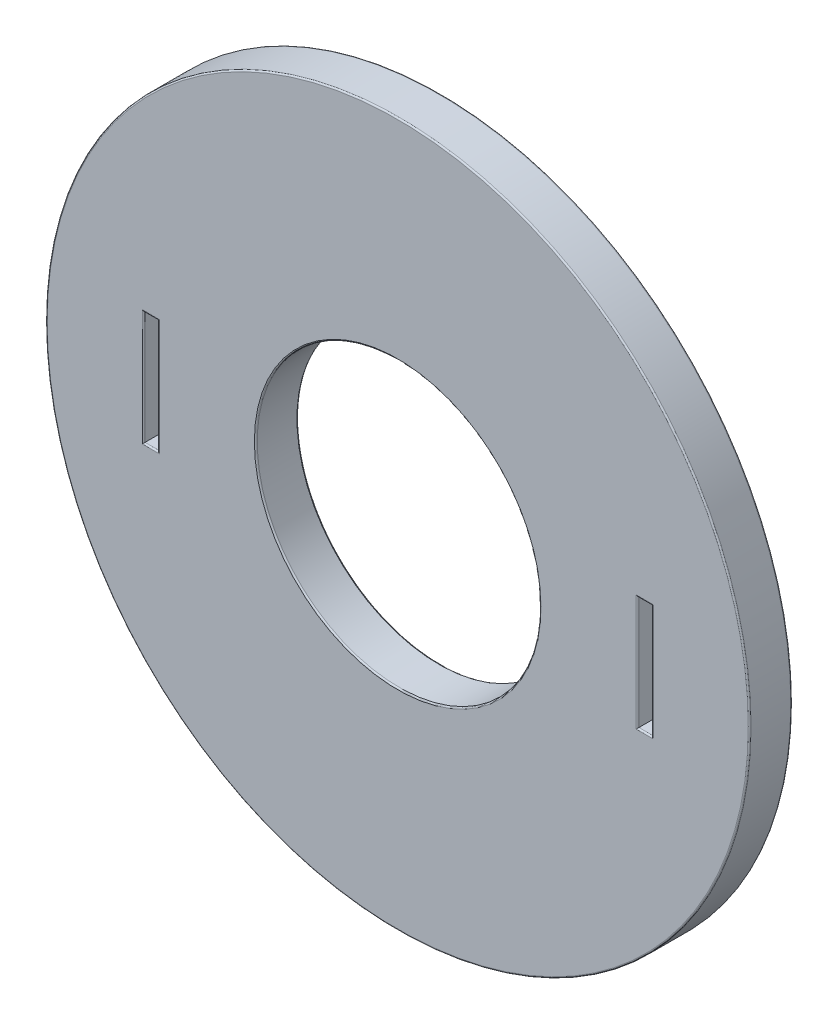
ISO-10303-21;
HEADER;
FILE_DESCRIPTION(('STEP AP214'),'2;1');
FILE_NAME('part.step','',(''),(''),'','','');
FILE_SCHEMA(('AUTOMOTIVE_DESIGN { 1 0 10303 214 1 1 1 1 }'));
ENDSEC;
DATA;
#1=APPLICATION_CONTEXT('core data for automotive mechanical design processes');
#2=APPLICATION_PROTOCOL_DEFINITION('international standard','automotive_design',2000,#1);
#3=PRODUCT_CONTEXT('',#1,'mechanical');
#4=PRODUCT('Part','Part','',(#3));
#5=PRODUCT_RELATED_PRODUCT_CATEGORY('part','',(#4));
#6=PRODUCT_DEFINITION_FORMATION('','',#4);
#7=PRODUCT_DEFINITION_CONTEXT('part definition',#1,'design');
#8=PRODUCT_DEFINITION('design','',#6,#7);
#9=PRODUCT_DEFINITION_SHAPE('','',#8);
#10=(LENGTH_UNIT() NAMED_UNIT(*) SI_UNIT(.MILLI.,.METRE.));
#11=(NAMED_UNIT(*) PLANE_ANGLE_UNIT() SI_UNIT($,.RADIAN.));
#12=(NAMED_UNIT(*) SI_UNIT($,.STERADIAN.) SOLID_ANGLE_UNIT());
#13=UNCERTAINTY_MEASURE_WITH_UNIT(LENGTH_MEASURE(1.E-05),#10,'distance_accuracy_value','');
#14=(GEOMETRIC_REPRESENTATION_CONTEXT(3) GLOBAL_UNCERTAINTY_ASSIGNED_CONTEXT((#13)) GLOBAL_UNIT_ASSIGNED_CONTEXT((#10,
#11,#12)) REPRESENTATION_CONTEXT('',''));
#15=CARTESIAN_POINT('',(0.,0.,0.));
#16=DIRECTION('',(0.,0.,1.));
#17=DIRECTION('',(1.,0.,0.));
#18=AXIS2_PLACEMENT_3D('',#15,#16,#17);
#19=CARTESIAN_POINT('',(0.,0.,1.5));
#20=DIRECTION('',(0.,0.,-1.));
#21=DIRECTION('',(-1.,0.,0.));
#22=AXIS2_PLACEMENT_3D('',#19,#20,#21);
#23=CYLINDRICAL_SURFACE('',#22,12.4);
#24=CARTESIAN_POINT('',(0.,0.,0.0499999999999999));
#25=DIRECTION('',(0.,0.,1.));
#26=DIRECTION('',(1.,0.,0.));
#27=AXIS2_PLACEMENT_3D('',#24,#25,#26);
#28=CIRCLE('',#27,12.4);
#29=CARTESIAN_POINT('',(12.4,0.,0.0499999999999999));
#30=VERTEX_POINT('',#29);
#31=EDGE_CURVE('E175',#30,#30,#28,.T.);
#32=ORIENTED_EDGE('',*,*,#31,.T.);
#33=EDGE_LOOP('',(#32));
#34=FACE_BOUND('',#33,.T.);
#35=CARTESIAN_POINT('',(0.,0.,1.45));
#36=DIRECTION('',(0.,0.,1.));
#37=DIRECTION('',(1.,0.,0.));
#38=AXIS2_PLACEMENT_3D('',#35,#36,#37);
#39=CIRCLE('',#38,12.4);
#40=CARTESIAN_POINT('',(12.4,0.,1.45));
#41=VERTEX_POINT('',#40);
#42=EDGE_CURVE('E424',#41,#41,#39,.F.);
#43=ORIENTED_EDGE('',*,*,#42,.T.);
#44=EDGE_LOOP('',(#43));
#45=FACE_BOUND('',#44,.T.);
#46=ADVANCED_FACE('F34',(#34,#45),#23,.T.);
#47=CARTESIAN_POINT('',(0.,0.,1.5));
#48=DIRECTION('',(0.,0.,1.));
#49=DIRECTION('',(1.,0.,0.));
#50=AXIS2_PLACEMENT_3D('',#47,#48,#49);
#51=PLANE('',#50);
#52=CARTESIAN_POINT('',(0.,0.,1.5));
#53=DIRECTION('',(0.,0.,1.));
#54=DIRECTION('',(1.,0.,0.));
#55=AXIS2_PLACEMENT_3D('',#52,#53,#54);
#56=CIRCLE('',#55,12.35);
#57=CARTESIAN_POINT('',(12.35,0.,1.5));
#58=VERTEX_POINT('',#57);
#59=EDGE_CURVE('E215',#58,#58,#56,.T.);
#60=ORIENTED_EDGE('',*,*,#59,.T.);
#61=EDGE_LOOP('',(#60));
#62=FACE_BOUND('',#61,.T.);
#63=CARTESIAN_POINT('',(0.,0.,1.5));
#64=DIRECTION('',(0.,0.,1.));
#65=DIRECTION('',(1.,0.,0.));
#66=AXIS2_PLACEMENT_3D('',#63,#64,#65);
#67=CIRCLE('',#66,5.05);
#68=CARTESIAN_POINT('',(5.05,0.,1.5));
#69=VERTEX_POINT('',#68);
#70=EDGE_CURVE('E212',#69,#69,#67,.F.);
#71=ORIENTED_EDGE('',*,*,#70,.T.);
#72=EDGE_LOOP('',(#71));
#73=FACE_BOUND('',#72,.T.);
#74=DIRECTION('',(0.,1.,0.));
#75=VECTOR('',#74,1.);
#76=CARTESIAN_POINT('',(-8.4,-2.,1.5));
#77=LINE('',#76,#75);
#78=CARTESIAN_POINT('',(-8.4,2.05,1.5));
#79=VERTEX_POINT('',#78);
#80=CARTESIAN_POINT('',(-8.4,-2.05,1.5));
#81=VERTEX_POINT('',#80);
#82=EDGE_CURVE('E207',#79,#81,#77,.F.);
#83=ORIENTED_EDGE('',*,*,#82,.T.);
#84=DIRECTION('',(1.,0.,0.));
#85=VECTOR('',#84,1.);
#86=CARTESIAN_POINT('',(-8.95,-2.05,1.5));
#87=LINE('',#86,#85);
#88=CARTESIAN_POINT('',(-9.,-2.05,1.5));
#89=VERTEX_POINT('',#88);
#90=EDGE_CURVE('E209',#81,#89,#87,.F.);
#91=ORIENTED_EDGE('',*,*,#90,.T.);
#92=DIRECTION('',(0.,-1.,0.));
#93=VECTOR('',#92,1.);
#94=CARTESIAN_POINT('',(-9.,2.,1.5));
#95=LINE('',#94,#93);
#96=CARTESIAN_POINT('',(-9.,2.05,1.5));
#97=VERTEX_POINT('',#96);
#98=EDGE_CURVE('E203',#89,#97,#95,.F.);
#99=ORIENTED_EDGE('',*,*,#98,.T.);
#100=DIRECTION('',(-1.,0.,0.));
#101=VECTOR('',#100,1.);
#102=CARTESIAN_POINT('',(-8.45,2.05,1.5));
#103=LINE('',#102,#101);
#104=EDGE_CURVE('E205',#97,#79,#103,.F.);
#105=ORIENTED_EDGE('',*,*,#104,.T.);
#106=EDGE_LOOP('',(#83,#91,#99,#105));
#107=FACE_BOUND('',#106,.T.);
#108=DIRECTION('',(0.,1.,0.));
#109=VECTOR('',#108,1.);
#110=CARTESIAN_POINT('',(9.,-2.,1.5));
#111=LINE('',#110,#109);
#112=CARTESIAN_POINT('',(9.,2.05,1.5));
#113=VERTEX_POINT('',#112);
#114=CARTESIAN_POINT('',(9.,-2.05,1.5));
#115=VERTEX_POINT('',#114);
#116=EDGE_CURVE('E198',#113,#115,#111,.F.);
#117=ORIENTED_EDGE('',*,*,#116,.T.);
#118=DIRECTION('',(1.,0.,0.));
#119=VECTOR('',#118,1.);
#120=CARTESIAN_POINT('',(8.45,-2.05,1.5));
#121=LINE('',#120,#119);
#122=CARTESIAN_POINT('',(8.4,-2.05,1.5));
#123=VERTEX_POINT('',#122);
#124=EDGE_CURVE('E200',#115,#123,#121,.F.);
#125=ORIENTED_EDGE('',*,*,#124,.T.);
#126=DIRECTION('',(0.,-1.,0.));
#127=VECTOR('',#126,1.);
#128=CARTESIAN_POINT('',(8.4,2.,1.5));
#129=LINE('',#128,#127);
#130=CARTESIAN_POINT('',(8.4,2.05,1.5));
#131=VERTEX_POINT('',#130);
#132=EDGE_CURVE('E194',#123,#131,#129,.F.);
#133=ORIENTED_EDGE('',*,*,#132,.T.);
#134=DIRECTION('',(-1.,0.,0.));
#135=VECTOR('',#134,1.);
#136=CARTESIAN_POINT('',(8.95,2.05,1.5));
#137=LINE('',#136,#135);
#138=EDGE_CURVE('E196',#131,#113,#137,.F.);
#139=ORIENTED_EDGE('',*,*,#138,.T.);
#140=EDGE_LOOP('',(#117,#125,#133,#139));
#141=FACE_BOUND('',#140,.T.);
#142=ADVANCED_FACE('F316',(#62,#73,#107,#141),#51,.T.);
#143=CARTESIAN_POINT('',(0.,0.,0.));
#144=DIRECTION('',(0.,0.,1.));
#145=DIRECTION('',(1.,0.,0.));
#146=AXIS2_PLACEMENT_3D('',#143,#144,#145);
#147=PLANE('',#146);
#148=CARTESIAN_POINT('',(0.,0.,0.));
#149=DIRECTION('',(0.,0.,1.));
#150=DIRECTION('',(1.,0.,0.));
#151=AXIS2_PLACEMENT_3D('',#148,#149,#150);
#152=CIRCLE('',#151,12.35);
#153=CARTESIAN_POINT('',(12.35,0.,0.));
#154=VERTEX_POINT('',#153);
#155=EDGE_CURVE('E191',#154,#154,#152,.F.);
#156=ORIENTED_EDGE('',*,*,#155,.T.);
#157=EDGE_LOOP('',(#156));
#158=FACE_BOUND('',#157,.T.);
#159=DIRECTION('',(0.,-1.,0.));
#160=VECTOR('',#159,1.);
#161=CARTESIAN_POINT('',(-9.,0.,0.));
#162=LINE('',#161,#160);
#163=CARTESIAN_POINT('',(-9.,2.05,0.));
#164=VERTEX_POINT('',#163);
#165=CARTESIAN_POINT('',(-9.,-2.05,0.));
#166=VERTEX_POINT('',#165);
#167=EDGE_CURVE('E186',#164,#166,#162,.T.);
#168=ORIENTED_EDGE('',*,*,#167,.T.);
#169=DIRECTION('',(1.,0.,0.));
#170=VECTOR('',#169,1.);
#171=CARTESIAN_POINT('',(0.,-2.05,0.));
#172=LINE('',#171,#170);
#173=CARTESIAN_POINT('',(-8.4,-2.05,0.));
#174=VERTEX_POINT('',#173);
#175=EDGE_CURVE('E188',#166,#174,#172,.T.);
#176=ORIENTED_EDGE('',*,*,#175,.T.);
#177=DIRECTION('',(0.,1.,0.));
#178=VECTOR('',#177,1.);
#179=CARTESIAN_POINT('',(-8.4,0.,0.));
#180=LINE('',#179,#178);
#181=CARTESIAN_POINT('',(-8.4,2.05,0.));
#182=VERTEX_POINT('',#181);
#183=EDGE_CURVE('E184',#174,#182,#180,.T.);
#184=ORIENTED_EDGE('',*,*,#183,.T.);
#185=DIRECTION('',(-1.,0.,0.));
#186=VECTOR('',#185,1.);
#187=CARTESIAN_POINT('',(0.,2.04999999999999,0.));
#188=LINE('',#187,#186);
#189=EDGE_CURVE('E182',#182,#164,#188,.T.);
#190=ORIENTED_EDGE('',*,*,#189,.T.);
#191=EDGE_LOOP('',(#168,#176,#184,#190));
#192=FACE_BOUND('',#191,.T.);
#193=DIRECTION('',(0.,-1.,0.));
#194=VECTOR('',#193,1.);
#195=CARTESIAN_POINT('',(8.4,0.,0.));
#196=LINE('',#195,#194);
#197=CARTESIAN_POINT('',(8.4,2.05,0.));
#198=VERTEX_POINT('',#197);
#199=CARTESIAN_POINT('',(8.4,-2.05,0.));
#200=VERTEX_POINT('',#199);
#201=EDGE_CURVE('E154',#198,#200,#196,.T.);
#202=ORIENTED_EDGE('',*,*,#201,.T.);
#203=DIRECTION('',(1.,0.,0.));
#204=VECTOR('',#203,1.);
#205=CARTESIAN_POINT('',(0.,-2.05,0.));
#206=LINE('',#205,#204);
#207=CARTESIAN_POINT('',(9.,-2.05,0.));
#208=VERTEX_POINT('',#207);
#209=EDGE_CURVE('E180',#200,#208,#206,.T.);
#210=ORIENTED_EDGE('',*,*,#209,.T.);
#211=DIRECTION('',(0.,1.,0.));
#212=VECTOR('',#211,1.);
#213=CARTESIAN_POINT('',(9.,0.,0.));
#214=LINE('',#213,#212);
#215=CARTESIAN_POINT('',(9.,2.05,0.));
#216=VERTEX_POINT('',#215);
#217=EDGE_CURVE('E157',#208,#216,#214,.T.);
#218=ORIENTED_EDGE('',*,*,#217,.T.);
#219=DIRECTION('',(-1.,0.,0.));
#220=VECTOR('',#219,1.);
#221=CARTESIAN_POINT('',(0.,2.05000000000001,0.));
#222=LINE('',#221,#220);
#223=EDGE_CURVE('E148',#216,#198,#222,.T.);
#224=ORIENTED_EDGE('',*,*,#223,.T.);
#225=EDGE_LOOP('',(#202,#210,#218,#224));
#226=FACE_BOUND('',#225,.T.);
#227=CARTESIAN_POINT('',(0.,0.,0.));
#228=DIRECTION('',(0.,0.,1.));
#229=DIRECTION('',(1.,0.,0.));
#230=AXIS2_PLACEMENT_3D('',#227,#228,#229);
#231=CIRCLE('',#230,5.05);
#232=CARTESIAN_POINT('',(5.05,0.,0.));
#233=VERTEX_POINT('',#232);
#234=EDGE_CURVE('E172',#233,#233,#231,.T.);
#235=ORIENTED_EDGE('',*,*,#234,.T.);
#236=EDGE_LOOP('',(#235));
#237=FACE_BOUND('',#236,.T.);
#238=ADVANCED_FACE('F150',(#158,#192,#226,#237),#147,.F.);
#239=CARTESIAN_POINT('',(0.,0.,0.));
#240=DIRECTION('',(0.,0.,1.));
#241=DIRECTION('',(1.,0.,0.));
#242=AXIS2_PLACEMENT_3D('',#239,#240,#241);
#243=CYLINDRICAL_SURFACE('',#242,5.);
#244=CARTESIAN_POINT('',(0.,0.,1.45));
#245=DIRECTION('',(0.,0.,1.));
#246=DIRECTION('',(1.,0.,0.));
#247=AXIS2_PLACEMENT_3D('',#244,#245,#246);
#248=CIRCLE('',#247,5.);
#249=CARTESIAN_POINT('',(5.,0.,1.45));
#250=VERTEX_POINT('',#249);
#251=EDGE_CURVE('E221',#250,#250,#248,.T.);
#252=ORIENTED_EDGE('',*,*,#251,.T.);
#253=EDGE_LOOP('',(#252));
#254=FACE_BOUND('',#253,.T.);
#255=CARTESIAN_POINT('',(0.,0.,0.05));
#256=DIRECTION('',(0.,0.,1.));
#257=DIRECTION('',(1.,0.,0.));
#258=AXIS2_PLACEMENT_3D('',#255,#256,#257);
#259=CIRCLE('',#258,5.);
#260=CARTESIAN_POINT('',(5.,0.,0.05));
#261=VERTEX_POINT('',#260);
#262=EDGE_CURVE('E218',#261,#261,#259,.F.);
#263=ORIENTED_EDGE('',*,*,#262,.T.);
#264=EDGE_LOOP('',(#263));
#265=FACE_BOUND('',#264,.T.);
#266=ADVANCED_FACE('F467',(#254,#265),#243,.F.);
#267=CARTESIAN_POINT('',(-8.95,2.,0.));
#268=DIRECTION('',(-1.,0.,0.));
#269=DIRECTION('',(0.,0.,1.));
#270=AXIS2_PLACEMENT_3D('',#267,#268,#269);
#271=PLANE('',#270);
#272=DIRECTION('',(0.,0.,1.));
#273=VECTOR('',#272,1.);
#274=CARTESIAN_POINT('',(-8.95,2.,0.));
#275=LINE('',#274,#273);
#276=CARTESIAN_POINT('',(-8.95,2.,0.05));
#277=VERTEX_POINT('',#276);
#278=CARTESIAN_POINT('',(-8.95,2.,1.45));
#279=VERTEX_POINT('',#278);
#280=EDGE_CURVE('E419',#277,#279,#275,.T.);
#281=ORIENTED_EDGE('',*,*,#280,.T.);
#282=DIRECTION('',(0.,-1.,0.));
#283=VECTOR('',#282,1.);
#284=CARTESIAN_POINT('',(-8.95,-2.,1.45));
#285=LINE('',#284,#283);
#286=CARTESIAN_POINT('',(-8.95,-2.,1.45));
#287=VERTEX_POINT('',#286);
#288=EDGE_CURVE('E240',#279,#287,#285,.T.);
#289=ORIENTED_EDGE('',*,*,#288,.T.);
#290=DIRECTION('',(0.,0.,1.));
#291=VECTOR('',#290,1.);
#292=CARTESIAN_POINT('',(-8.95,-2.,0.));
#293=LINE('',#292,#291);
#294=CARTESIAN_POINT('',(-8.95,-2.,0.05));
#295=VERTEX_POINT('',#294);
#296=EDGE_CURVE('E409',#295,#287,#293,.T.);
#297=ORIENTED_EDGE('',*,*,#296,.F.);
#298=DIRECTION('',(0.,-1.,0.));
#299=VECTOR('',#298,1.);
#300=CARTESIAN_POINT('',(-8.95,2.,0.05));
#301=LINE('',#300,#299);
#302=EDGE_CURVE('E238',#295,#277,#301,.F.);
#303=ORIENTED_EDGE('',*,*,#302,.T.);
#304=EDGE_LOOP('',(#281,#289,#297,#303));
#305=FACE_BOUND('',#304,.T.);
#306=ADVANCED_FACE('F418',(#305),#271,.F.);
#307=CARTESIAN_POINT('',(-8.95,2.,0.));
#308=DIRECTION('',(0.,1.,0.));
#309=DIRECTION('',(-1.,0.,0.));
#310=AXIS2_PLACEMENT_3D('',#307,#308,#309);
#311=PLANE('',#310);
#312=DIRECTION('',(0.,0.,1.));
#313=VECTOR('',#312,1.);
#314=CARTESIAN_POINT('',(-8.45,2.,0.));
#315=LINE('',#314,#313);
#316=CARTESIAN_POINT('',(-8.45,2.,0.05));
#317=VERTEX_POINT('',#316);
#318=CARTESIAN_POINT('',(-8.45,2.,1.45));
#319=VERTEX_POINT('',#318);
#320=EDGE_CURVE('E402',#317,#319,#315,.T.);
#321=ORIENTED_EDGE('',*,*,#320,.T.);
#322=DIRECTION('',(-1.,0.,0.));
#323=VECTOR('',#322,1.);
#324=CARTESIAN_POINT('',(-8.95,2.,1.45));
#325=LINE('',#324,#323);
#326=EDGE_CURVE('E236',#319,#279,#325,.T.);
#327=ORIENTED_EDGE('',*,*,#326,.T.);
#328=ORIENTED_EDGE('',*,*,#280,.F.);
#329=DIRECTION('',(-1.,0.,0.));
#330=VECTOR('',#329,1.);
#331=CARTESIAN_POINT('',(-8.95,2.,0.05));
#332=LINE('',#331,#330);
#333=EDGE_CURVE('E234',#277,#317,#332,.F.);
#334=ORIENTED_EDGE('',*,*,#333,.T.);
#335=EDGE_LOOP('',(#321,#327,#328,#334));
#336=FACE_BOUND('',#335,.T.);
#337=ADVANCED_FACE('F422',(#336),#311,.F.);
#338=CARTESIAN_POINT('',(-8.45,2.,0.));
#339=DIRECTION('',(1.,0.,0.));
#340=DIRECTION('',(0.,0.,-1.));
#341=AXIS2_PLACEMENT_3D('',#338,#339,#340);
#342=PLANE('',#341);
#343=DIRECTION('',(0.,0.,1.));
#344=VECTOR('',#343,1.);
#345=CARTESIAN_POINT('',(-8.45,-2.,0.));
#346=LINE('',#345,#344);
#347=CARTESIAN_POINT('',(-8.45,-2.,0.05));
#348=VERTEX_POINT('',#347);
#349=CARTESIAN_POINT('',(-8.45,-2.,1.45));
#350=VERTEX_POINT('',#349);
#351=EDGE_CURVE('E400',#348,#350,#346,.T.);
#352=ORIENTED_EDGE('',*,*,#351,.T.);
#353=DIRECTION('',(0.,1.,0.));
#354=VECTOR('',#353,1.);
#355=CARTESIAN_POINT('',(-8.45,2.,1.45));
#356=LINE('',#355,#354);
#357=EDGE_CURVE('E232',#350,#319,#356,.T.);
#358=ORIENTED_EDGE('',*,*,#357,.T.);
#359=ORIENTED_EDGE('',*,*,#320,.F.);
#360=DIRECTION('',(0.,1.,0.));
#361=VECTOR('',#360,1.);
#362=CARTESIAN_POINT('',(-8.45,2.,0.05));
#363=LINE('',#362,#361);
#364=EDGE_CURVE('E230',#317,#348,#363,.F.);
#365=ORIENTED_EDGE('',*,*,#364,.T.);
#366=EDGE_LOOP('',(#352,#358,#359,#365));
#367=FACE_BOUND('',#366,.T.);
#368=ADVANCED_FACE('F399',(#367),#342,.F.);
#369=CARTESIAN_POINT('',(-8.95,-2.,0.));
#370=DIRECTION('',(0.,-1.,0.));
#371=DIRECTION('',(0.,0.,-1.));
#372=AXIS2_PLACEMENT_3D('',#369,#370,#371);
#373=PLANE('',#372);
#374=ORIENTED_EDGE('',*,*,#296,.T.);
#375=DIRECTION('',(1.,0.,0.));
#376=VECTOR('',#375,1.);
#377=CARTESIAN_POINT('',(-8.45,-2.,1.45));
#378=LINE('',#377,#376);
#379=EDGE_CURVE('E227',#287,#350,#378,.T.);
#380=ORIENTED_EDGE('',*,*,#379,.T.);
#381=ORIENTED_EDGE('',*,*,#351,.F.);
#382=DIRECTION('',(1.,0.,0.));
#383=VECTOR('',#382,1.);
#384=CARTESIAN_POINT('',(-8.95,-2.,0.05));
#385=LINE('',#384,#383);
#386=EDGE_CURVE('E224',#348,#295,#385,.F.);
#387=ORIENTED_EDGE('',*,*,#386,.T.);
#388=EDGE_LOOP('',(#374,#380,#381,#387));
#389=FACE_BOUND('',#388,.T.);
#390=ADVANCED_FACE('F406',(#389),#373,.F.);
#391=CARTESIAN_POINT('',(8.45,2.,0.));
#392=DIRECTION('',(-1.,0.,0.));
#393=DIRECTION('',(0.,0.,1.));
#394=AXIS2_PLACEMENT_3D('',#391,#392,#393);
#395=PLANE('',#394);
#396=DIRECTION('',(0.,0.,1.));
#397=VECTOR('',#396,1.);
#398=CARTESIAN_POINT('',(8.45,2.,0.));
#399=LINE('',#398,#397);
#400=CARTESIAN_POINT('',(8.45,2.,0.05));
#401=VERTEX_POINT('',#400);
#402=CARTESIAN_POINT('',(8.45,2.,1.45));
#403=VERTEX_POINT('',#402);
#404=EDGE_CURVE('E431',#401,#403,#399,.T.);
#405=ORIENTED_EDGE('',*,*,#404,.T.);
#406=DIRECTION('',(0.,-1.,0.));
#407=VECTOR('',#406,1.);
#408=CARTESIAN_POINT('',(8.45,-2.,1.45));
#409=LINE('',#408,#407);
#410=CARTESIAN_POINT('',(8.45,-2.,1.45));
#411=VERTEX_POINT('',#410);
#412=EDGE_CURVE('E11',#403,#411,#409,.T.);
#413=ORIENTED_EDGE('',*,*,#412,.T.);
#414=DIRECTION('',(0.,0.,1.));
#415=VECTOR('',#414,1.);
#416=CARTESIAN_POINT('',(8.45,-2.,0.));
#417=LINE('',#416,#415);
#418=CARTESIAN_POINT('',(8.45,-2.,0.05));
#419=VERTEX_POINT('',#418);
#420=EDGE_CURVE('E266',#419,#411,#417,.T.);
#421=ORIENTED_EDGE('',*,*,#420,.F.);
#422=DIRECTION('',(0.,-1.,0.));
#423=VECTOR('',#422,1.);
#424=CARTESIAN_POINT('',(8.45,2.,0.05));
#425=LINE('',#424,#423);
#426=EDGE_CURVE('E43',#419,#401,#425,.F.);
#427=ORIENTED_EDGE('',*,*,#426,.T.);
#428=EDGE_LOOP('',(#405,#413,#421,#427));
#429=FACE_BOUND('',#428,.T.);
#430=ADVANCED_FACE('F449',(#429),#395,.F.);
#431=CARTESIAN_POINT('',(8.45,2.,0.));
#432=DIRECTION('',(0.,1.,0.));
#433=DIRECTION('',(-1.,0.,0.));
#434=AXIS2_PLACEMENT_3D('',#431,#432,#433);
#435=PLANE('',#434);
#436=DIRECTION('',(0.,0.,1.));
#437=VECTOR('',#436,1.);
#438=CARTESIAN_POINT('',(8.95,2.,0.));
#439=LINE('',#438,#437);
#440=CARTESIAN_POINT('',(8.95,2.,0.05));
#441=VERTEX_POINT('',#440);
#442=CARTESIAN_POINT('',(8.95,2.,1.45));
#443=VERTEX_POINT('',#442);
#444=EDGE_CURVE('E297',#441,#443,#439,.T.);
#445=ORIENTED_EDGE('',*,*,#444,.T.);
#446=DIRECTION('',(-1.,0.,0.));
#447=VECTOR('',#446,1.);
#448=CARTESIAN_POINT('',(8.45,2.,1.45));
#449=LINE('',#448,#447);
#450=EDGE_CURVE('E51',#443,#403,#449,.T.);
#451=ORIENTED_EDGE('',*,*,#450,.T.);
#452=ORIENTED_EDGE('',*,*,#404,.F.);
#453=DIRECTION('',(-1.,0.,0.));
#454=VECTOR('',#453,1.);
#455=CARTESIAN_POINT('',(8.45,2.,0.05));
#456=LINE('',#455,#454);
#457=EDGE_CURVE('E165',#401,#441,#456,.F.);
#458=ORIENTED_EDGE('',*,*,#457,.T.);
#459=EDGE_LOOP('',(#445,#451,#452,#458));
#460=FACE_BOUND('',#459,.T.);
#461=ADVANCED_FACE('F438',(#460),#435,.F.);
#462=CARTESIAN_POINT('',(8.95,2.,0.));
#463=DIRECTION('',(1.,0.,0.));
#464=DIRECTION('',(0.,0.,-1.));
#465=AXIS2_PLACEMENT_3D('',#462,#463,#464);
#466=PLANE('',#465);
#467=DIRECTION('',(0.,0.,1.));
#468=VECTOR('',#467,1.);
#469=CARTESIAN_POINT('',(8.95,-2.,0.));
#470=LINE('',#469,#468);
#471=CARTESIAN_POINT('',(8.95,-2.,0.05));
#472=VERTEX_POINT('',#471);
#473=CARTESIAN_POINT('',(8.95,-2.,1.45));
#474=VERTEX_POINT('',#473);
#475=EDGE_CURVE('E296',#472,#474,#470,.T.);
#476=ORIENTED_EDGE('',*,*,#475,.T.);
#477=DIRECTION('',(0.,1.,0.));
#478=VECTOR('',#477,1.);
#479=CARTESIAN_POINT('',(8.95,2.,1.45));
#480=LINE('',#479,#478);
#481=EDGE_CURVE('E250',#474,#443,#480,.T.);
#482=ORIENTED_EDGE('',*,*,#481,.T.);
#483=ORIENTED_EDGE('',*,*,#444,.F.);
#484=DIRECTION('',(0.,1.,0.));
#485=VECTOR('',#484,1.);
#486=CARTESIAN_POINT('',(8.95,2.,0.05));
#487=LINE('',#486,#485);
#488=EDGE_CURVE('E248',#441,#472,#487,.F.);
#489=ORIENTED_EDGE('',*,*,#488,.T.);
#490=EDGE_LOOP('',(#476,#482,#483,#489));
#491=FACE_BOUND('',#490,.T.);
#492=ADVANCED_FACE('F295',(#491),#466,.F.);
#493=CARTESIAN_POINT('',(8.45,-2.,0.));
#494=DIRECTION('',(0.,-1.,0.));
#495=DIRECTION('',(0.,0.,-1.));
#496=AXIS2_PLACEMENT_3D('',#493,#494,#495);
#497=PLANE('',#496);
#498=ORIENTED_EDGE('',*,*,#420,.T.);
#499=DIRECTION('',(1.,0.,0.));
#500=VECTOR('',#499,1.);
#501=CARTESIAN_POINT('',(8.95,-2.,1.45));
#502=LINE('',#501,#500);
#503=EDGE_CURVE('E245',#411,#474,#502,.T.);
#504=ORIENTED_EDGE('',*,*,#503,.T.);
#505=ORIENTED_EDGE('',*,*,#475,.F.);
#506=DIRECTION('',(1.,0.,0.));
#507=VECTOR('',#506,1.);
#508=CARTESIAN_POINT('',(8.45,-2.,0.05));
#509=LINE('',#508,#507);
#510=EDGE_CURVE('E242',#472,#419,#509,.F.);
#511=ORIENTED_EDGE('',*,*,#510,.T.);
#512=EDGE_LOOP('',(#498,#504,#505,#511));
#513=FACE_BOUND('',#512,.T.);
#514=ADVANCED_FACE('F301',(#513),#497,.F.);
#515=CARTESIAN_POINT('',(0.,0.,0.0499999999999999));
#516=DIRECTION('',(0.,0.,1.));
#517=DIRECTION('',(1.,0.,0.));
#518=AXIS2_PLACEMENT_3D('',#515,#516,#517);
#519=TOROIDAL_SURFACE('',#518,12.35,0.05);
#520=ORIENTED_EDGE('',*,*,#155,.F.);
#521=EDGE_LOOP('',(#520));
#522=FACE_BOUND('',#521,.T.);
#523=ORIENTED_EDGE('',*,*,#31,.F.);
#524=EDGE_LOOP('',(#523));
#525=FACE_BOUND('',#524,.T.);
#526=ADVANCED_FACE('F328',(#522,#525),#519,.T.);
#527=CARTESIAN_POINT('',(0.,0.,1.45));
#528=DIRECTION('',(0.,0.,1.));
#529=DIRECTION('',(1.,0.,0.));
#530=AXIS2_PLACEMENT_3D('',#527,#528,#529);
#531=TOROIDAL_SURFACE('',#530,12.35,0.05);
#532=ORIENTED_EDGE('',*,*,#42,.F.);
#533=EDGE_LOOP('',(#532));
#534=FACE_BOUND('',#533,.T.);
#535=ORIENTED_EDGE('',*,*,#59,.F.);
#536=EDGE_LOOP('',(#535));
#537=FACE_BOUND('',#536,.T.);
#538=ADVANCED_FACE('F331',(#534,#537),#531,.T.);
#539=CARTESIAN_POINT('',(0.,0.,1.45));
#540=DIRECTION('',(0.,0.,1.));
#541=DIRECTION('',(1.,0.,0.));
#542=AXIS2_PLACEMENT_3D('',#539,#540,#541);
#543=TOROIDAL_SURFACE('',#542,5.05,0.05);
#544=ORIENTED_EDGE('',*,*,#70,.F.);
#545=EDGE_LOOP('',(#544));
#546=FACE_BOUND('',#545,.T.);
#547=ORIENTED_EDGE('',*,*,#251,.F.);
#548=EDGE_LOOP('',(#547));
#549=FACE_BOUND('',#548,.T.);
#550=ADVANCED_FACE('F335',(#546,#549),#543,.T.);
#551=CARTESIAN_POINT('',(-8.95,2.05,1.45));
#552=DIRECTION('',(1.,0.,0.));
#553=DIRECTION('',(0.,1.,0.));
#554=AXIS2_PLACEMENT_3D('',#551,#552,#553);
#555=CYLINDRICAL_SURFACE('',#554,0.05);
#556=CARTESIAN_POINT('',(-8.4,2.05,1.45));
#557=DIRECTION('',(0.707106781186547,-0.707106781186548,0.));
#558=DIRECTION('',(-0.707106781186548,-0.707106781186547,0.));
#559=AXIS2_PLACEMENT_3D('',#556,#557,#558);
#560=ELLIPSE('',#559,0.0707106781186547,0.05);
#561=EDGE_CURVE('E260',#79,#319,#560,.T.);
#562=ORIENTED_EDGE('',*,*,#561,.F.);
#563=ORIENTED_EDGE('',*,*,#104,.F.);
#564=CARTESIAN_POINT('',(-9.,2.05,1.45));
#565=DIRECTION('',(0.707106781186548,0.707106781186547,0.));
#566=DIRECTION('',(0.707106781186547,-0.707106781186548,0.));
#567=AXIS2_PLACEMENT_3D('',#564,#565,#566);
#568=ELLIPSE('',#567,0.0707106781186548,0.05);
#569=EDGE_CURVE('E263',#279,#97,#568,.F.);
#570=ORIENTED_EDGE('',*,*,#569,.F.);
#571=ORIENTED_EDGE('',*,*,#326,.F.);
#572=EDGE_LOOP('',(#562,#563,#570,#571));
#573=FACE_BOUND('',#572,.T.);
#574=ADVANCED_FACE('F339',(#573),#555,.T.);
#575=CARTESIAN_POINT('',(-9.,2.,1.45));
#576=DIRECTION('',(0.,1.,0.));
#577=DIRECTION('',(0.,0.,1.));
#578=AXIS2_PLACEMENT_3D('',#575,#576,#577);
#579=CYLINDRICAL_SURFACE('',#578,0.05);
#580=ORIENTED_EDGE('',*,*,#569,.T.);
#581=ORIENTED_EDGE('',*,*,#98,.F.);
#582=CARTESIAN_POINT('',(-9.,-2.05,1.45));
#583=DIRECTION('',(-0.707106781186547,0.707106781186547,0.));
#584=DIRECTION('',(-0.707106781186547,-0.707106781186547,0.));
#585=AXIS2_PLACEMENT_3D('',#582,#583,#584);
#586=ELLIPSE('',#585,0.0707106781186548,0.05);
#587=EDGE_CURVE('E257',#287,#89,#586,.F.);
#588=ORIENTED_EDGE('',*,*,#587,.F.);
#589=ORIENTED_EDGE('',*,*,#288,.F.);
#590=EDGE_LOOP('',(#580,#581,#588,#589));
#591=FACE_BOUND('',#590,.T.);
#592=ADVANCED_FACE('F349',(#591),#579,.T.);
#593=CARTESIAN_POINT('',(-8.4,2.,1.45));
#594=DIRECTION('',(0.,-1.,0.));
#595=DIRECTION('',(0.,0.,-1.));
#596=AXIS2_PLACEMENT_3D('',#593,#594,#595);
#597=CYLINDRICAL_SURFACE('',#596,0.05);
#598=ORIENTED_EDGE('',*,*,#561,.T.);
#599=ORIENTED_EDGE('',*,*,#357,.F.);
#600=CARTESIAN_POINT('',(-8.4,-2.05,1.45));
#601=DIRECTION('',(-0.707106781186547,-0.707106781186547,0.));
#602=DIRECTION('',(-0.707106781186547,0.707106781186547,0.));
#603=AXIS2_PLACEMENT_3D('',#600,#601,#602);
#604=ELLIPSE('',#603,0.0707106781186548,0.05);
#605=EDGE_CURVE('E255',#81,#350,#604,.T.);
#606=ORIENTED_EDGE('',*,*,#605,.F.);
#607=ORIENTED_EDGE('',*,*,#82,.F.);
#608=EDGE_LOOP('',(#598,#599,#606,#607));
#609=FACE_BOUND('',#608,.T.);
#610=ADVANCED_FACE('F345',(#609),#597,.T.);
#611=CARTESIAN_POINT('',(-8.95,-2.05,1.45));
#612=DIRECTION('',(-1.,0.,0.));
#613=DIRECTION('',(0.,0.,1.));
#614=AXIS2_PLACEMENT_3D('',#611,#612,#613);
#615=CYLINDRICAL_SURFACE('',#614,0.05);
#616=ORIENTED_EDGE('',*,*,#587,.T.);
#617=ORIENTED_EDGE('',*,*,#90,.F.);
#618=ORIENTED_EDGE('',*,*,#605,.T.);
#619=ORIENTED_EDGE('',*,*,#379,.F.);
#620=EDGE_LOOP('',(#616,#617,#618,#619));
#621=FACE_BOUND('',#620,.T.);
#622=ADVANCED_FACE('F341',(#621),#615,.T.);
#623=CARTESIAN_POINT('',(8.45,2.05,1.45));
#624=DIRECTION('',(1.,0.,0.));
#625=DIRECTION('',(0.,1.,0.));
#626=AXIS2_PLACEMENT_3D('',#623,#624,#625);
#627=CYLINDRICAL_SURFACE('',#626,0.05);
#628=CARTESIAN_POINT('',(9.,2.05,1.45));
#629=DIRECTION('',(0.707106781186547,-0.707106781186548,0.));
#630=DIRECTION('',(-0.707106781186548,-0.707106781186547,0.));
#631=AXIS2_PLACEMENT_3D('',#628,#629,#630);
#632=ELLIPSE('',#631,0.0707106781186547,0.05);
#633=EDGE_CURVE('E272',#113,#443,#632,.T.);
#634=ORIENTED_EDGE('',*,*,#633,.F.);
#635=ORIENTED_EDGE('',*,*,#138,.F.);
#636=CARTESIAN_POINT('',(8.4,2.05,1.45));
#637=DIRECTION('',(0.707106781186548,0.707106781186547,0.));
#638=DIRECTION('',(0.707106781186547,-0.707106781186548,0.));
#639=AXIS2_PLACEMENT_3D('',#636,#637,#638);
#640=ELLIPSE('',#639,0.0707106781186548,0.05);
#641=EDGE_CURVE('E258',#403,#131,#640,.F.);
#642=ORIENTED_EDGE('',*,*,#641,.F.);
#643=ORIENTED_EDGE('',*,*,#450,.F.);
#644=EDGE_LOOP('',(#634,#635,#642,#643));
#645=FACE_BOUND('',#644,.T.);
#646=ADVANCED_FACE('F344',(#645),#627,.T.);
#647=CARTESIAN_POINT('',(8.4,2.,1.45));
#648=DIRECTION('',(0.,1.,0.));
#649=DIRECTION('',(0.,0.,1.));
#650=AXIS2_PLACEMENT_3D('',#647,#648,#649);
#651=CYLINDRICAL_SURFACE('',#650,0.05);
#652=ORIENTED_EDGE('',*,*,#641,.T.);
#653=ORIENTED_EDGE('',*,*,#132,.F.);
#654=CARTESIAN_POINT('',(8.4,-2.05,1.45));
#655=DIRECTION('',(-0.707106781186547,0.707106781186547,0.));
#656=DIRECTION('',(-0.707106781186547,-0.707106781186547,0.));
#657=AXIS2_PLACEMENT_3D('',#654,#655,#656);
#658=ELLIPSE('',#657,0.0707106781186548,0.05);
#659=EDGE_CURVE('E269',#411,#123,#658,.F.);
#660=ORIENTED_EDGE('',*,*,#659,.F.);
#661=ORIENTED_EDGE('',*,*,#412,.F.);
#662=EDGE_LOOP('',(#652,#653,#660,#661));
#663=FACE_BOUND('',#662,.T.);
#664=ADVANCED_FACE('F365',(#663),#651,.T.);
#665=CARTESIAN_POINT('',(9.,2.,1.45));
#666=DIRECTION('',(0.,-1.,0.));
#667=DIRECTION('',(0.,0.,-1.));
#668=AXIS2_PLACEMENT_3D('',#665,#666,#667);
#669=CYLINDRICAL_SURFACE('',#668,0.05);
#670=ORIENTED_EDGE('',*,*,#633,.T.);
#671=ORIENTED_EDGE('',*,*,#481,.F.);
#672=CARTESIAN_POINT('',(9.,-2.05,1.45));
#673=DIRECTION('',(-0.707106781186547,-0.707106781186547,0.));
#674=DIRECTION('',(-0.707106781186547,0.707106781186547,0.));
#675=AXIS2_PLACEMENT_3D('',#672,#673,#674);
#676=ELLIPSE('',#675,0.0707106781186548,0.05);
#677=EDGE_CURVE('E267',#115,#474,#676,.T.);
#678=ORIENTED_EDGE('',*,*,#677,.F.);
#679=ORIENTED_EDGE('',*,*,#116,.F.);
#680=EDGE_LOOP('',(#670,#671,#678,#679));
#681=FACE_BOUND('',#680,.T.);
#682=ADVANCED_FACE('F361',(#681),#669,.T.);
#683=CARTESIAN_POINT('',(8.45,-2.05,1.45));
#684=DIRECTION('',(-1.,0.,0.));
#685=DIRECTION('',(0.,0.,1.));
#686=AXIS2_PLACEMENT_3D('',#683,#684,#685);
#687=CYLINDRICAL_SURFACE('',#686,0.05);
#688=ORIENTED_EDGE('',*,*,#659,.T.);
#689=ORIENTED_EDGE('',*,*,#124,.F.);
#690=ORIENTED_EDGE('',*,*,#677,.T.);
#691=ORIENTED_EDGE('',*,*,#503,.F.);
#692=EDGE_LOOP('',(#688,#689,#690,#691));
#693=FACE_BOUND('',#692,.T.);
#694=ADVANCED_FACE('F357',(#693),#687,.T.);
#695=CARTESIAN_POINT('',(0.,2.04999999999999,0.05));
#696=DIRECTION('',(-1.,0.,0.));
#697=DIRECTION('',(0.,-1.,0.));
#698=AXIS2_PLACEMENT_3D('',#695,#696,#697);
#699=CYLINDRICAL_SURFACE('',#698,0.05);
#700=CARTESIAN_POINT('',(-8.4,2.05,0.05));
#701=DIRECTION('',(-0.707106781186547,0.707106781186548,0.));
#702=DIRECTION('',(0.707106781186548,0.707106781186547,0.));
#703=AXIS2_PLACEMENT_3D('',#700,#701,#702);
#704=ELLIPSE('',#703,0.0707106781186547,0.05);
#705=EDGE_CURVE('E280',#317,#182,#704,.F.);
#706=ORIENTED_EDGE('',*,*,#705,.F.);
#707=ORIENTED_EDGE('',*,*,#333,.F.);
#708=CARTESIAN_POINT('',(-9.,2.05,0.05));
#709=DIRECTION('',(-0.707106781186548,-0.707106781186547,0.));
#710=DIRECTION('',(0.707106781186547,-0.707106781186548,0.));
#711=AXIS2_PLACEMENT_3D('',#708,#709,#710);
#712=ELLIPSE('',#711,0.0707106781186548,0.05);
#713=EDGE_CURVE('E270',#164,#277,#712,.T.);
#714=ORIENTED_EDGE('',*,*,#713,.F.);
#715=ORIENTED_EDGE('',*,*,#189,.F.);
#716=EDGE_LOOP('',(#706,#707,#714,#715));
#717=FACE_BOUND('',#716,.T.);
#718=ADVANCED_FACE('F360',(#717),#699,.T.);
#719=CARTESIAN_POINT('',(-9.,0.,0.05));
#720=DIRECTION('',(0.,-1.,0.));
#721=DIRECTION('',(0.,0.,-1.));
#722=AXIS2_PLACEMENT_3D('',#719,#720,#721);
#723=CYLINDRICAL_SURFACE('',#722,0.05);
#724=ORIENTED_EDGE('',*,*,#713,.T.);
#725=ORIENTED_EDGE('',*,*,#302,.F.);
#726=CARTESIAN_POINT('',(-9.,-2.05,0.05));
#727=DIRECTION('',(0.707106781186547,-0.707106781186547,0.));
#728=DIRECTION('',(0.707106781186547,0.707106781186547,0.));
#729=AXIS2_PLACEMENT_3D('',#726,#727,#728);
#730=ELLIPSE('',#729,0.0707106781186548,0.05);
#731=EDGE_CURVE('E278',#166,#295,#730,.T.);
#732=ORIENTED_EDGE('',*,*,#731,.F.);
#733=ORIENTED_EDGE('',*,*,#167,.F.);
#734=EDGE_LOOP('',(#724,#725,#732,#733));
#735=FACE_BOUND('',#734,.T.);
#736=ADVANCED_FACE('F380',(#735),#723,.T.);
#737=CARTESIAN_POINT('',(-8.4,0.,0.05));
#738=DIRECTION('',(0.,1.,0.));
#739=DIRECTION('',(0.,0.,1.));
#740=AXIS2_PLACEMENT_3D('',#737,#738,#739);
#741=CYLINDRICAL_SURFACE('',#740,0.05);
#742=ORIENTED_EDGE('',*,*,#705,.T.);
#743=ORIENTED_EDGE('',*,*,#183,.F.);
#744=CARTESIAN_POINT('',(-8.4,-2.05,0.05));
#745=DIRECTION('',(0.707106781186547,0.707106781186547,0.));
#746=DIRECTION('',(0.707106781186547,-0.707106781186547,0.));
#747=AXIS2_PLACEMENT_3D('',#744,#745,#746);
#748=ELLIPSE('',#747,0.0707106781186548,0.05);
#749=EDGE_CURVE('E167',#348,#174,#748,.F.);
#750=ORIENTED_EDGE('',*,*,#749,.F.);
#751=ORIENTED_EDGE('',*,*,#364,.F.);
#752=EDGE_LOOP('',(#742,#743,#750,#751));
#753=FACE_BOUND('',#752,.T.);
#754=ADVANCED_FACE('F376',(#753),#741,.T.);
#755=CARTESIAN_POINT('',(0.,-2.05,0.05));
#756=DIRECTION('',(1.,0.,0.));
#757=DIRECTION('',(0.,0.,-1.));
#758=AXIS2_PLACEMENT_3D('',#755,#756,#757);
#759=CYLINDRICAL_SURFACE('',#758,0.05);
#760=ORIENTED_EDGE('',*,*,#731,.T.);
#761=ORIENTED_EDGE('',*,*,#386,.F.);
#762=ORIENTED_EDGE('',*,*,#749,.T.);
#763=ORIENTED_EDGE('',*,*,#175,.F.);
#764=EDGE_LOOP('',(#760,#761,#762,#763));
#765=FACE_BOUND('',#764,.T.);
#766=ADVANCED_FACE('F373',(#765),#759,.T.);
#767=CARTESIAN_POINT('',(0.,2.05000000000001,0.05));
#768=DIRECTION('',(-1.,0.,0.));
#769=DIRECTION('',(0.,-1.,0.));
#770=AXIS2_PLACEMENT_3D('',#767,#768,#769);
#771=CYLINDRICAL_SURFACE('',#770,0.05);
#772=CARTESIAN_POINT('',(9.,2.05,0.05));
#773=DIRECTION('',(-0.707106781186547,0.707106781186548,0.));
#774=DIRECTION('',(0.707106781186548,0.707106781186547,0.));
#775=AXIS2_PLACEMENT_3D('',#772,#773,#774);
#776=ELLIPSE('',#775,0.0707106781186547,0.05);
#777=EDGE_CURVE('E168',#441,#216,#776,.F.);
#778=ORIENTED_EDGE('',*,*,#777,.F.);
#779=ORIENTED_EDGE('',*,*,#457,.F.);
#780=CARTESIAN_POINT('',(8.4,2.05,0.05));
#781=DIRECTION('',(-0.707106781186548,-0.707106781186547,0.));
#782=DIRECTION('',(-0.707106781186547,0.707106781186548,0.));
#783=AXIS2_PLACEMENT_3D('',#780,#781,#782);
#784=ELLIPSE('',#783,0.0707106781186548,0.05);
#785=EDGE_CURVE('E38',#198,#401,#784,.T.);
#786=ORIENTED_EDGE('',*,*,#785,.F.);
#787=ORIENTED_EDGE('',*,*,#223,.F.);
#788=EDGE_LOOP('',(#778,#779,#786,#787));
#789=FACE_BOUND('',#788,.T.);
#790=ADVANCED_FACE('F164',(#789),#771,.T.);
#791=CARTESIAN_POINT('',(8.4,0.,0.05));
#792=DIRECTION('',(0.,-1.,0.));
#793=DIRECTION('',(0.,0.,-1.));
#794=AXIS2_PLACEMENT_3D('',#791,#792,#793);
#795=CYLINDRICAL_SURFACE('',#794,0.05);
#796=ORIENTED_EDGE('',*,*,#785,.T.);
#797=ORIENTED_EDGE('',*,*,#426,.F.);
#798=CARTESIAN_POINT('',(8.4,-2.05,0.05));
#799=DIRECTION('',(0.707106781186547,-0.707106781186547,0.));
#800=DIRECTION('',(0.707106781186547,0.707106781186547,0.));
#801=AXIS2_PLACEMENT_3D('',#798,#799,#800);
#802=ELLIPSE('',#801,0.0707106781186548,0.05);
#803=EDGE_CURVE('E170',#200,#419,#802,.T.);
#804=ORIENTED_EDGE('',*,*,#803,.F.);
#805=ORIENTED_EDGE('',*,*,#201,.F.);
#806=EDGE_LOOP('',(#796,#797,#804,#805));
#807=FACE_BOUND('',#806,.T.);
#808=ADVANCED_FACE('F169',(#807),#795,.T.);
#809=CARTESIAN_POINT('',(9.,0.,0.05));
#810=DIRECTION('',(0.,1.,0.));
#811=DIRECTION('',(0.,0.,1.));
#812=AXIS2_PLACEMENT_3D('',#809,#810,#811);
#813=CYLINDRICAL_SURFACE('',#812,0.05);
#814=ORIENTED_EDGE('',*,*,#777,.T.);
#815=ORIENTED_EDGE('',*,*,#217,.F.);
#816=CARTESIAN_POINT('',(9.,-2.05,0.05));
#817=DIRECTION('',(0.707106781186547,0.707106781186547,0.));
#818=DIRECTION('',(0.707106781186547,-0.707106781186547,0.));
#819=AXIS2_PLACEMENT_3D('',#816,#817,#818);
#820=ELLIPSE('',#819,0.0707106781186548,0.05);
#821=EDGE_CURVE('E285',#472,#208,#820,.F.);
#822=ORIENTED_EDGE('',*,*,#821,.F.);
#823=ORIENTED_EDGE('',*,*,#488,.F.);
#824=EDGE_LOOP('',(#814,#815,#822,#823));
#825=FACE_BOUND('',#824,.T.);
#826=ADVANCED_FACE('F289',(#825),#813,.T.);
#827=CARTESIAN_POINT('',(0.,-2.05,0.05));
#828=DIRECTION('',(1.,0.,0.));
#829=DIRECTION('',(0.,0.,-1.));
#830=AXIS2_PLACEMENT_3D('',#827,#828,#829);
#831=CYLINDRICAL_SURFACE('',#830,0.05);
#832=ORIENTED_EDGE('',*,*,#803,.T.);
#833=ORIENTED_EDGE('',*,*,#510,.F.);
#834=ORIENTED_EDGE('',*,*,#821,.T.);
#835=ORIENTED_EDGE('',*,*,#209,.F.);
#836=EDGE_LOOP('',(#832,#833,#834,#835));
#837=FACE_BOUND('',#836,.T.);
#838=ADVANCED_FACE('F305',(#837),#831,.T.);
#839=CARTESIAN_POINT('',(0.,0.,0.05));
#840=DIRECTION('',(0.,0.,1.));
#841=DIRECTION('',(1.,0.,0.));
#842=AXIS2_PLACEMENT_3D('',#839,#840,#841);
#843=TOROIDAL_SURFACE('',#842,5.05,0.05);
#844=ORIENTED_EDGE('',*,*,#262,.F.);
#845=EDGE_LOOP('',(#844));
#846=FACE_BOUND('',#845,.T.);
#847=ORIENTED_EDGE('',*,*,#234,.F.);
#848=EDGE_LOOP('',(#847));
#849=FACE_BOUND('',#848,.T.);
#850=ADVANCED_FACE('F36',(#846,#849),#843,.T.);
#851=CLOSED_SHELL('',(#46,#142,#238,#266,#306,#337,#368,#390,#430,#461,#492,#514,#526,#538,#550,
#574,#592,#610,#622,#646,#664,#682,#694,#718,#736,#754,#766,#790,#808,#826,#838,#850));
#852=MANIFOLD_SOLID_BREP('B2',#851);
#853=ADVANCED_BREP_SHAPE_REPRESENTATION('',(#18,#852),#14);
#854=SHAPE_DEFINITION_REPRESENTATION(#9,#853);
ENDSEC;
END-ISO-10303-21;
